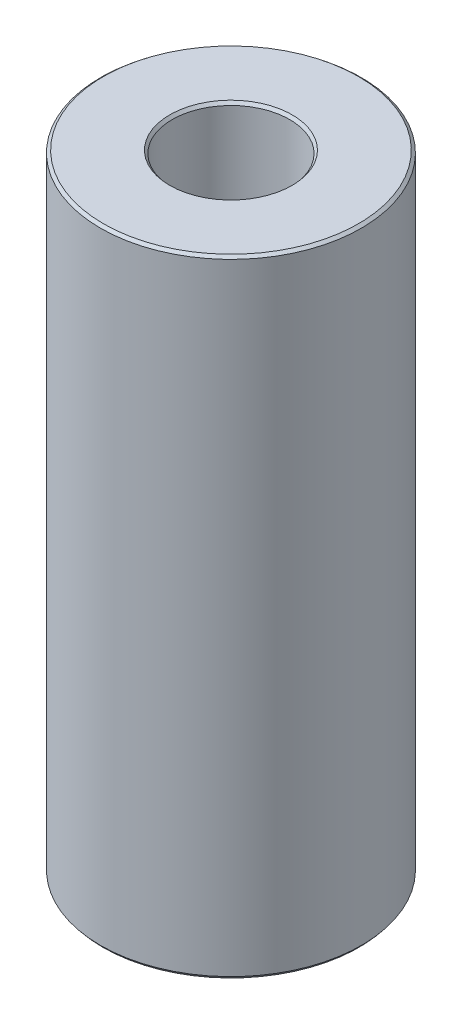
ISO-10303-21;
HEADER;
FILE_DESCRIPTION(('STEP AP214'),'2;1');
FILE_NAME('part.step','',(''),(''),'','','');
FILE_SCHEMA(('AUTOMOTIVE_DESIGN { 1 0 10303 214 1 1 1 1 }'));
ENDSEC;
DATA;
#1=APPLICATION_CONTEXT('core data for automotive mechanical design processes');
#2=APPLICATION_PROTOCOL_DEFINITION('international standard','automotive_design',2000,#1);
#3=PRODUCT_CONTEXT('',#1,'mechanical');
#4=PRODUCT('Part','Part','',(#3));
#5=PRODUCT_RELATED_PRODUCT_CATEGORY('part','',(#4));
#6=PRODUCT_DEFINITION_FORMATION('','',#4);
#7=PRODUCT_DEFINITION_CONTEXT('part definition',#1,'design');
#8=PRODUCT_DEFINITION('design','',#6,#7);
#9=PRODUCT_DEFINITION_SHAPE('','',#8);
#10=(LENGTH_UNIT() NAMED_UNIT(*) SI_UNIT(.MILLI.,.METRE.));
#11=(NAMED_UNIT(*) PLANE_ANGLE_UNIT() SI_UNIT($,.RADIAN.));
#12=(NAMED_UNIT(*) SI_UNIT($,.STERADIAN.) SOLID_ANGLE_UNIT());
#13=UNCERTAINTY_MEASURE_WITH_UNIT(LENGTH_MEASURE(1.E-05),#10,'distance_accuracy_value','');
#14=(GEOMETRIC_REPRESENTATION_CONTEXT(3) GLOBAL_UNCERTAINTY_ASSIGNED_CONTEXT((#13)) GLOBAL_UNIT_ASSIGNED_CONTEXT((#10,
#11,#12)) REPRESENTATION_CONTEXT('',''));
#15=CARTESIAN_POINT('',(0.,0.,0.));
#16=DIRECTION('',(0.,0.,1.));
#17=DIRECTION('',(1.,0.,0.));
#18=AXIS2_PLACEMENT_3D('',#15,#16,#17);
#19=CARTESIAN_POINT('',(0.,168.064445702901,0.));
#20=DIRECTION('',(0.,-1.,0.));
#21=DIRECTION('',(0.,0.,-1.));
#22=AXIS2_PLACEMENT_3D('',#19,#20,#21);
#23=CYLINDRICAL_SURFACE('',#22,35.);
#24=CARTESIAN_POINT('',(0.,0.782957546975105,0.));
#25=DIRECTION('',(0.,1.,0.));
#26=DIRECTION('',(0.,0.,1.));
#27=AXIS2_PLACEMENT_3D('',#24,#25,#26);
#28=CIRCLE('',#27,35.);
#29=CARTESIAN_POINT('',(0.,0.782957546975105,35.));
#30=VERTEX_POINT('',#29);
#31=EDGE_CURVE('E10',#30,#30,#28,.T.);
#32=ORIENTED_EDGE('',*,*,#31,.T.);
#33=EDGE_LOOP('',(#32));
#34=FACE_BOUND('',#33,.T.);
#35=CARTESIAN_POINT('',(0.,167.420494925924,0.));
#36=DIRECTION('',(0.,1.,0.));
#37=DIRECTION('',(0.,0.,1.));
#38=AXIS2_PLACEMENT_3D('',#35,#36,#37);
#39=CIRCLE('',#38,35.);
#40=CARTESIAN_POINT('',(0.,167.420494925924,35.));
#41=VERTEX_POINT('',#40);
#42=EDGE_CURVE('E50',#41,#41,#39,.F.);
#43=ORIENTED_EDGE('',*,*,#42,.T.);
#44=EDGE_LOOP('',(#43));
#45=FACE_BOUND('',#44,.T.);
#46=ADVANCED_FACE('F39',(#34,#45),#23,.T.);
#47=CARTESIAN_POINT('',(0.,168.064445702901,0.));
#48=DIRECTION('',(0.,1.,0.));
#49=DIRECTION('',(0.,0.,1.));
#50=AXIS2_PLACEMENT_3D('',#47,#48,#49);
#51=PLANE('',#50);
#52=CARTESIAN_POINT('',(0.,168.064445702901,0.));
#53=DIRECTION('',(0.,1.,0.));
#54=DIRECTION('',(0.,0.,1.));
#55=AXIS2_PLACEMENT_3D('',#52,#53,#54);
#56=CIRCLE('',#55,16.4169561253561);
#57=CARTESIAN_POINT('',(0.,168.064445702901,16.4169561253561));
#58=VERTEX_POINT('',#57);
#59=EDGE_CURVE('E58',#58,#58,#56,.F.);
#60=ORIENTED_EDGE('',*,*,#59,.T.);
#61=EDGE_LOOP('',(#60));
#62=FACE_BOUND('',#61,.T.);
#63=CARTESIAN_POINT('',(0.,168.064445702901,0.));
#64=DIRECTION('',(0.,1.,0.));
#65=DIRECTION('',(0.,0.,1.));
#66=AXIS2_PLACEMENT_3D('',#63,#64,#65);
#67=CIRCLE('',#66,34.2170424530249);
#68=CARTESIAN_POINT('',(0.,168.064445702901,34.2170424530249));
#69=VERTEX_POINT('',#68);
#70=EDGE_CURVE('E61',#69,#69,#67,.T.);
#71=ORIENTED_EDGE('',*,*,#70,.T.);
#72=EDGE_LOOP('',(#71));
#73=FACE_BOUND('',#72,.T.);
#74=ADVANCED_FACE('F88',(#62,#73),#51,.T.);
#75=CARTESIAN_POINT('',(0.,0.,0.));
#76=DIRECTION('',(0.,1.,0.));
#77=DIRECTION('',(0.,0.,1.));
#78=AXIS2_PLACEMENT_3D('',#75,#76,#77);
#79=PLANE('',#78);
#80=CARTESIAN_POINT('',(0.,0.,0.));
#81=DIRECTION('',(0.,1.,0.));
#82=DIRECTION('',(0.,0.,1.));
#83=AXIS2_PLACEMENT_3D('',#80,#81,#82);
#84=CIRCLE('',#83,16.5559628953539);
#85=CARTESIAN_POINT('',(0.,0.,16.5559628953539));
#86=VERTEX_POINT('',#85);
#87=EDGE_CURVE('E51',#86,#86,#84,.T.);
#88=ORIENTED_EDGE('',*,*,#87,.T.);
#89=EDGE_LOOP('',(#88));
#90=FACE_BOUND('',#89,.T.);
#91=CARTESIAN_POINT('',(0.,0.,0.));
#92=DIRECTION('',(0.,1.,0.));
#93=DIRECTION('',(0.,0.,1.));
#94=AXIS2_PLACEMENT_3D('',#91,#92,#93);
#95=CIRCLE('',#94,34.3560492230228);
#96=CARTESIAN_POINT('',(0.,0.,34.3560492230228));
#97=VERTEX_POINT('',#96);
#98=EDGE_CURVE('E54',#97,#97,#95,.F.);
#99=ORIENTED_EDGE('',*,*,#98,.T.);
#100=EDGE_LOOP('',(#99));
#101=FACE_BOUND('',#100,.T.);
#102=ADVANCED_FACE('F83',(#90,#101),#79,.F.);
#103=CARTESIAN_POINT('',(0.,168.064445702901,0.));
#104=DIRECTION('',(0.,-1.,0.));
#105=DIRECTION('',(0.,0.,-1.));
#106=AXIS2_PLACEMENT_3D('',#103,#104,#105);
#107=CYLINDRICAL_SURFACE('',#106,15.7730053483789);
#108=CARTESIAN_POINT('',(0.,167.281488155926,0.));
#109=DIRECTION('',(0.,1.,0.));
#110=DIRECTION('',(0.,0.,1.));
#111=AXIS2_PLACEMENT_3D('',#108,#109,#110);
#112=CIRCLE('',#111,15.7730053483789);
#113=CARTESIAN_POINT('',(0.,167.281488155926,15.7730053483789));
#114=VERTEX_POINT('',#113);
#115=EDGE_CURVE('E67',#114,#114,#112,.T.);
#116=ORIENTED_EDGE('',*,*,#115,.T.);
#117=EDGE_LOOP('',(#116));
#118=FACE_BOUND('',#117,.T.);
#119=CARTESIAN_POINT('',(0.,0.643950776977126,0.));
#120=DIRECTION('',(0.,1.,0.));
#121=DIRECTION('',(0.,0.,1.));
#122=AXIS2_PLACEMENT_3D('',#119,#120,#121);
#123=CIRCLE('',#122,15.7730053483789);
#124=CARTESIAN_POINT('',(0.,0.643950776977126,15.7730053483789));
#125=VERTEX_POINT('',#124);
#126=EDGE_CURVE('E69',#125,#125,#123,.F.);
#127=ORIENTED_EDGE('',*,*,#126,.T.);
#128=EDGE_LOOP('',(#127));
#129=FACE_BOUND('',#128,.T.);
#130=ADVANCED_FACE('F71',(#118,#129),#107,.F.);
#131=CARTESIAN_POINT('',(0.,167.281488155926,0.));
#132=DIRECTION('',(0.,1.,0.));
#133=DIRECTION('',(0.,0.,1.));
#134=AXIS2_PLACEMENT_3D('',#131,#132,#133);
#135=CONICAL_SURFACE('',#134,15.7730053483789,0.688286445493872);
#136=CARTESIAN_POINT('',(0.,168.064445702901,16.4169561253561));
#137=CARTESIAN_POINT('',(0.,168.05628989512,16.4102483047626));
#138=CARTESIAN_POINT('',(0.,168.048134087339,16.403540484169));
#139=CARTESIAN_POINT('',(0.,168.031822471777,16.390124842982));
#140=CARTESIAN_POINT('',(0.,168.023666663996,16.3834170223885));
#141=CARTESIAN_POINT('',(0.,168.007355048434,16.3700013812015));
#142=CARTESIAN_POINT('',(0.,167.999199240653,16.363293560608));
#143=CARTESIAN_POINT('',(0.,167.982887625091,16.3498779194209));
#144=CARTESIAN_POINT('',(0.,167.97473181731,16.3431700988274));
#145=CARTESIAN_POINT('',(0.,167.958420201748,16.3297544576404));
#146=CARTESIAN_POINT('',(0.,167.950264393967,16.3230466370469));
#147=CARTESIAN_POINT('',(0.,167.933952778405,16.3096309958599));
#148=CARTESIAN_POINT('',(0.,167.925796970624,16.3029231752664));
#149=CARTESIAN_POINT('',(0.,167.909485355062,16.2895075340793));
#150=CARTESIAN_POINT('',(0.,167.901329547281,16.2827997134858));
#151=CARTESIAN_POINT('',(0.,167.885017931719,16.2693840722988));
#152=CARTESIAN_POINT('',(0.,167.876862123938,16.2626762517053));
#153=CARTESIAN_POINT('',(0.,167.860550508376,16.2492606105183));
#154=CARTESIAN_POINT('',(0.,167.852394700595,16.2425527899247));
#155=CARTESIAN_POINT('',(0.,167.836083085033,16.2291371487377));
#156=CARTESIAN_POINT('',(0.,167.827927277252,16.2224293281442));
#157=CARTESIAN_POINT('',(0.,167.81161566169,16.2090136869572));
#158=CARTESIAN_POINT('',(0.,167.803459853909,16.2023058663637));
#159=CARTESIAN_POINT('',(0.,167.787148238347,16.1888902251767));
#160=CARTESIAN_POINT('',(0.,167.778992430566,16.1821824045831));
#161=CARTESIAN_POINT('',(0.,167.762680815004,16.1687667633961));
#162=CARTESIAN_POINT('',(0.,167.754525007223,16.1620589428026));
#163=CARTESIAN_POINT('',(0.,167.738213391661,16.1486433016156));
#164=CARTESIAN_POINT('',(0.,167.73005758388,16.1419354810221));
#165=CARTESIAN_POINT('',(0.,167.713745968318,16.128519839835));
#166=CARTESIAN_POINT('',(0.,167.705590160537,16.1218120192415));
#167=CARTESIAN_POINT('',(0.,167.689278544975,16.1083963780545));
#168=CARTESIAN_POINT('',(0.,167.681122737194,16.101688557461));
#169=CARTESIAN_POINT('',(0.,167.664811121632,16.088272916274));
#170=CARTESIAN_POINT('',(0.,167.656655313851,16.0815650956805));
#171=CARTESIAN_POINT('',(0.,167.640343698289,16.0681494544934));
#172=CARTESIAN_POINT('',(0.,167.632187890508,16.0614416338999));
#173=CARTESIAN_POINT('',(0.,167.615876274946,16.0480259927129));
#174=CARTESIAN_POINT('',(0.,167.607720467165,16.0413181721194));
#175=CARTESIAN_POINT('',(0.,167.591408851603,16.0279025309324));
#176=CARTESIAN_POINT('',(0.,167.583253043822,16.0211947103388));
#177=CARTESIAN_POINT('',(0.,167.56694142826,16.0077790691518));
#178=CARTESIAN_POINT('',(0.,167.558785620479,16.0010712485583));
#179=CARTESIAN_POINT('',(0.,167.542474004917,15.9876556073713));
#180=CARTESIAN_POINT('',(0.,167.534318197136,15.9809477867778));
#181=CARTESIAN_POINT('',(0.,167.518006581574,15.9675321455907));
#182=CARTESIAN_POINT('',(0.,167.509850773793,15.9608243249972));
#183=CARTESIAN_POINT('',(0.,167.493539158231,15.9474086838102));
#184=CARTESIAN_POINT('',(0.,167.48538335045,15.9407008632167));
#185=CARTESIAN_POINT('',(0.,167.469071734888,15.9272852220297));
#186=CARTESIAN_POINT('',(0.,167.460915927107,15.9205774014362));
#187=CARTESIAN_POINT('',(0.,167.444604311545,15.9071617602491));
#188=CARTESIAN_POINT('',(0.,167.436448503764,15.9004539396556));
#189=CARTESIAN_POINT('',(0.,167.420136888202,15.8870382984686));
#190=CARTESIAN_POINT('',(0.,167.411981080421,15.8803304778751));
#191=CARTESIAN_POINT('',(0.,167.395669464859,15.8669148366881));
#192=CARTESIAN_POINT('',(0.,167.387513657079,15.8602070160945));
#193=CARTESIAN_POINT('',(0.,167.371202041517,15.8467913749075));
#194=CARTESIAN_POINT('',(0.,167.363046233736,15.840083554314));
#195=CARTESIAN_POINT('',(0.,167.346734618174,15.826667913127));
#196=CARTESIAN_POINT('',(0.,167.338578810393,15.8199600925335));
#197=CARTESIAN_POINT('',(0.,167.322267194831,15.8065444513464));
#198=CARTESIAN_POINT('',(0.,167.31411138705,15.7998366307529));
#199=CARTESIAN_POINT('',(0.,167.297799771488,15.7864209895659));
#200=CARTESIAN_POINT('',(0.,167.289643963707,15.7797131689724));
#201=CARTESIAN_POINT('',(0.,167.281488155926,15.7730053483789));
#202=B_SPLINE_CURVE_WITH_KNOTS('',3,(#136,#137,#138,#139,#140,#141,#142,#143,#144,#145,#146,
#147,#148,#149,#150,#151,#152,#153,#154,#155,#156,#157,#158,#159,#160,#161,#162,#163,#164,#165,
#166,#167,#168,#169,#170,#171,#172,#173,#174,#175,#176,#177,#178,#179,#180,#181,#182,#183,#184,
#185,#186,#187,#188,#189,#190,#191,#192,#193,#194,#195,#196,#197,#198,#199,#200,#201),
.UNSPECIFIED.,.F.,.F.,(4,2,2,2,2,2,2,2,2,2,2,2,2,2,2,2,2,2,2,2,2,2,2,2,2,2,2,2,2,2,2,2,4),(0.,
0.031679780919018,0.063359561838036,0.095039342757054,0.12671912367607,0.158398904595088,
0.190078685514106,0.221758466433124,0.253438247352142,0.28511802827116,0.316797809190176,
0.348477590109194,0.380157371028212,0.41183715194723,0.443516932866248,0.475196713785263,
0.506876494704282,0.5385562756233,0.570236056542317,0.601915837461335,0.633595618380353,
0.665275399299369,0.696955180218387,0.728634961137405,0.760314742056423,0.791994522975441,
0.823674303894457,0.855354084813475,0.887033865732493,0.918713646651511,0.950393427570529,
0.982073208489545,1.01375298940854),.UNSPECIFIED.);
#203=EDGE_CURVE('BSEAM77',#58,#114,#202,.T.);
#204=ORIENTED_EDGE('',*,*,#59,.F.);
#205=ORIENTED_EDGE('',*,*,#115,.F.);
#206=ORIENTED_EDGE('',*,*,#203,.T.);
#207=ORIENTED_EDGE('',*,*,#203,.F.);
#208=EDGE_LOOP('',(#204,#206,#205,#207));
#209=FACE_BOUND('',#208,.T.);
#210=ADVANCED_FACE('F77',(#209),#135,.F.);
#211=CARTESIAN_POINT('',(0.,0.,0.));
#212=DIRECTION('',(0.,-1.,0.));
#213=DIRECTION('',(0.,0.,-1.));
#214=AXIS2_PLACEMENT_3D('',#211,#212,#213);
#215=CONICAL_SURFACE('',#214,16.5559628953539,0.88250988130105);
#216=ORIENTED_EDGE('',*,*,#126,.F.);
#217=EDGE_LOOP('',(#216));
#218=FACE_BOUND('',#217,.T.);
#219=ORIENTED_EDGE('',*,*,#87,.F.);
#220=EDGE_LOOP('',(#219));
#221=FACE_BOUND('',#220,.T.);
#222=ADVANCED_FACE('F73',(#218,#221),#215,.F.);
#223=CARTESIAN_POINT('',(0.,0.782957546975105,0.));
#224=DIRECTION('',(0.,1.,0.));
#225=DIRECTION('',(0.,0.,1.));
#226=AXIS2_PLACEMENT_3D('',#223,#224,#225);
#227=CONICAL_SURFACE('',#226,35.,0.688286445493865);
#228=CARTESIAN_POINT('',(0.,0.,34.3560492230228));
#229=CARTESIAN_POINT('',(0.,0.00815580778099244,34.3627570436163));
#230=CARTESIAN_POINT('',(0.,0.0163116155619825,34.3694648642098));
#231=CARTESIAN_POINT('',(0.,0.0326232311239625,34.3828805053969));
#232=CARTESIAN_POINT('',(0.,0.0407790389049525,34.3895883259904));
#233=CARTESIAN_POINT('',(0.,0.0570906544669342,34.4030039671774));
#234=CARTESIAN_POINT('',(0.,0.0652464622479259,34.4097117877709));
#235=CARTESIAN_POINT('',(0.,0.0815580778099072,34.4231274289579));
#236=CARTESIAN_POINT('',(0.,0.0897138855908967,34.4298352495514));
#237=CARTESIAN_POINT('',(0.,0.106025501152878,34.4432508907385));
#238=CARTESIAN_POINT('',(0.,0.11418130893387,34.449958711332));
#239=CARTESIAN_POINT('',(0.,0.130492924495851,34.463374352519));
#240=CARTESIAN_POINT('',(0.,0.138648732276841,34.4700821731125));
#241=CARTESIAN_POINT('',(0.,0.154960347838822,34.4834978142995));
#242=CARTESIAN_POINT('',(0.,0.163116155619814,34.4902056348931));
#243=CARTESIAN_POINT('',(0.,0.179427771181795,34.5036212760801));
#244=CARTESIAN_POINT('',(0.,0.187583578962785,34.5103290966736));
#245=CARTESIAN_POINT('',(0.,0.203895194524766,34.5237447378606));
#246=CARTESIAN_POINT('',(0.,0.212051002305758,34.5304525584541));
#247=CARTESIAN_POINT('',(0.,0.228362617867739,34.5438681996412));
#248=CARTESIAN_POINT('',(0.,0.236518425648729,34.5505760202347));
#249=CARTESIAN_POINT('',(0.,0.25283004121071,34.5639916614217));
#250=CARTESIAN_POINT('',(0.,0.260985848991702,34.5706994820152));
#251=CARTESIAN_POINT('',(0.,0.277297464553683,34.5841151232022));
#252=CARTESIAN_POINT('',(0.,0.285453272334673,34.5908229437958));
#253=CARTESIAN_POINT('',(0.,0.301764887896654,34.6042385849828));
#254=CARTESIAN_POINT('',(0.,0.309920695677646,34.6109464055763));
#255=CARTESIAN_POINT('',(0.,0.326232311239628,34.6243620467633));
#256=CARTESIAN_POINT('',(0.,0.334388119020617,34.6310698673568));
#257=CARTESIAN_POINT('',(0.,0.350699734582598,34.6444855085439));
#258=CARTESIAN_POINT('',(0.,0.358855542363589,34.6511933291374));
#259=CARTESIAN_POINT('',(0.,0.375167157925571,34.6646089703244));
#260=CARTESIAN_POINT('',(0.,0.383322965706562,34.6713167909179));
#261=CARTESIAN_POINT('',(0.,0.399634581268543,34.6847324321049));
#262=CARTESIAN_POINT('',(0.,0.407790389049533,34.6914402526984));
#263=CARTESIAN_POINT('',(0.,0.424102004611515,34.7048558938855));
#264=CARTESIAN_POINT('',(0.,0.432257812392506,34.711563714479));
#265=CARTESIAN_POINT('',(0.,0.448569427954488,34.724979355666));
#266=CARTESIAN_POINT('',(0.,0.456725235735477,34.7316871762595));
#267=CARTESIAN_POINT('',(0.,0.473036851297459,34.7451028174465));
#268=CARTESIAN_POINT('',(0.,0.48119265907845,34.75181063804));
#269=CARTESIAN_POINT('',(0.,0.497504274640432,34.7652262792271));
#270=CARTESIAN_POINT('',(0.,0.505660082421421,34.7719340998206));
#271=CARTESIAN_POINT('',(0.,0.521971697983403,34.7853497410076));
#272=CARTESIAN_POINT('',(0.,0.530127505764394,34.7920575616011));
#273=CARTESIAN_POINT('',(0.,0.546439121326376,34.8054732027881));
#274=CARTESIAN_POINT('',(0.,0.554594929107365,34.8121810233817));
#275=CARTESIAN_POINT('',(0.,0.570906544669347,34.8255966645687));
#276=CARTESIAN_POINT('',(0.,0.579062352450338,34.8323044851622));
#277=CARTESIAN_POINT('',(0.,0.59537396801232,34.8457201263492));
#278=CARTESIAN_POINT('',(0.,0.603529775793309,34.8524279469427));
#279=CARTESIAN_POINT('',(0.,0.619841391355291,34.8658435881298));
#280=CARTESIAN_POINT('',(0.,0.627997199136282,34.8725514087233));
#281=CARTESIAN_POINT('',(0.,0.644308814698264,34.8859670499103));
#282=CARTESIAN_POINT('',(0.,0.652464622479253,34.8926748705038));
#283=CARTESIAN_POINT('',(0.,0.668776238041235,34.9060905116908));
#284=CARTESIAN_POINT('',(0.,0.676932045822227,34.9127983322843));
#285=CARTESIAN_POINT('',(0.,0.693243661384208,34.9262139734714));
#286=CARTESIAN_POINT('',(0.,0.701399469165197,34.9329217940649));
#287=CARTESIAN_POINT('',(0.,0.717711084727179,34.9463374352519));
#288=CARTESIAN_POINT('',(0.,0.72586689250817,34.9530452558454));
#289=CARTESIAN_POINT('',(0.,0.742178508070152,34.9664608970324));
#290=CARTESIAN_POINT('',(0.,0.750334315851142,34.973168717626));
#291=CARTESIAN_POINT('',(0.,0.766645931413122,34.986584358813));
#292=CARTESIAN_POINT('',(0.,0.774801739194112,34.9932921794065));
#293=CARTESIAN_POINT('',(0.,0.782957546975105,35.));
#294=B_SPLINE_CURVE_WITH_KNOTS('',3,(#228,#229,#230,#231,#232,#233,#234,#235,#236,#237,#238,
#239,#240,#241,#242,#243,#244,#245,#246,#247,#248,#249,#250,#251,#252,#253,#254,#255,#256,#257,
#258,#259,#260,#261,#262,#263,#264,#265,#266,#267,#268,#269,#270,#271,#272,#273,#274,#275,#276,
#277,#278,#279,#280,#281,#282,#283,#284,#285,#286,#287,#288,#289,#290,#291,#292,#293),
.UNSPECIFIED.,.F.,.F.,(4,2,2,2,2,2,2,2,2,2,2,2,2,2,2,2,2,2,2,2,2,2,2,2,2,2,2,2,2,2,2,2,4),(0.,
0.0316797809190158,0.063359561838036,0.0950393427570518,0.126719123676072,0.158398904595088,
0.190078685514108,0.221758466433124,0.253438247352144,0.28511802827116,0.31679780919018,
0.348477590109196,0.380157371028216,0.411837151947232,0.443516932866252,0.475196713785268,
0.506876494704284,0.538556275623304,0.57023605654232,0.60191583746134,0.633595618380356,
0.665275399299376,0.696955180218392,0.728634961137412,0.760314742056428,0.791994522975448,
0.823674303894464,0.855354084813484,0.8870338657325,0.91871364665152,0.950393427570536,
0.982073208489556,1.01375298940857),.UNSPECIFIED.);
#295=EDGE_CURVE('BSEAM76',#97,#30,#294,.T.);
#296=ORIENTED_EDGE('',*,*,#98,.F.);
#297=ORIENTED_EDGE('',*,*,#31,.F.);
#298=ORIENTED_EDGE('',*,*,#295,.T.);
#299=ORIENTED_EDGE('',*,*,#295,.F.);
#300=EDGE_LOOP('',(#296,#298,#297,#299));
#301=FACE_BOUND('',#300,.T.);
#302=ADVANCED_FACE('F76',(#301),#227,.T.);
#303=CARTESIAN_POINT('',(0.,168.064445702901,0.));
#304=DIRECTION('',(0.,-1.,0.));
#305=DIRECTION('',(0.,0.,-1.));
#306=AXIS2_PLACEMENT_3D('',#303,#304,#305);
#307=CONICAL_SURFACE('',#306,34.2170424530249,0.882509881301076);
#308=ORIENTED_EDGE('',*,*,#42,.F.);
#309=EDGE_LOOP('',(#308));
#310=FACE_BOUND('',#309,.T.);
#311=ORIENTED_EDGE('',*,*,#70,.F.);
#312=EDGE_LOOP('',(#311));
#313=FACE_BOUND('',#312,.T.);
#314=ADVANCED_FACE('F45',(#310,#313),#307,.T.);
#315=CLOSED_SHELL('',(#46,#74,#102,#130,#210,#222,#302,#314));
#316=MANIFOLD_SOLID_BREP('B2',#315);
#317=ADVANCED_BREP_SHAPE_REPRESENTATION('',(#18,#316),#14);
#318=SHAPE_DEFINITION_REPRESENTATION(#9,#317);
ENDSEC;
END-ISO-10303-21;
